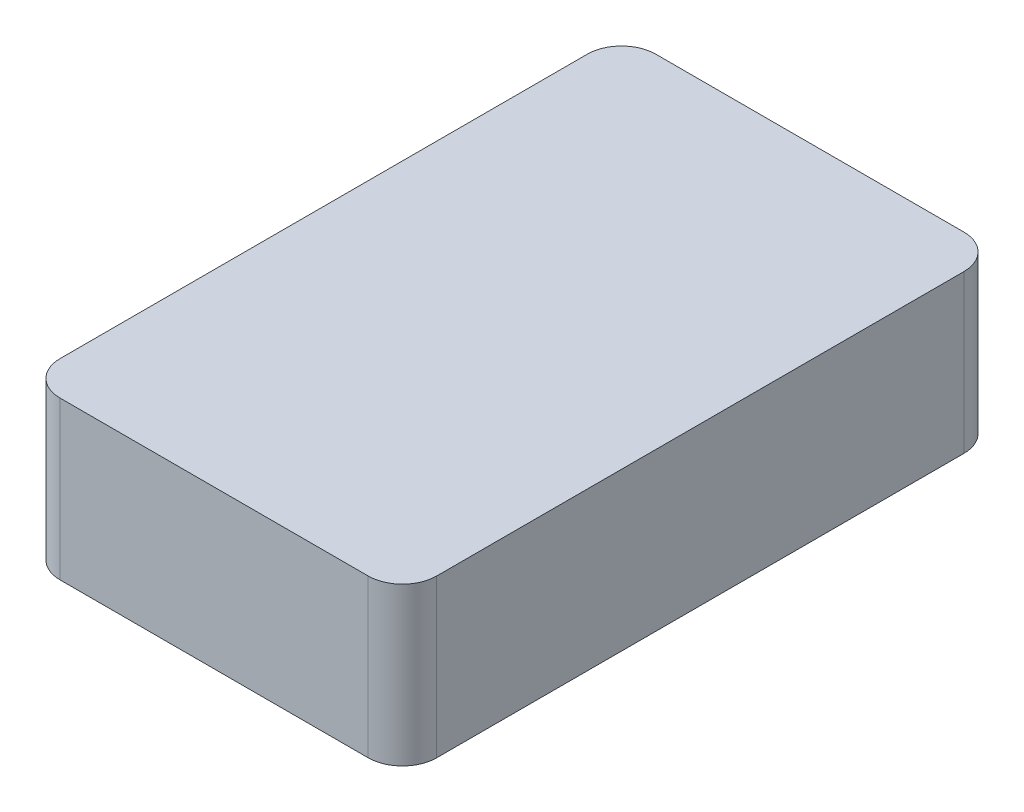
ISO-10303-21;
HEADER;
FILE_DESCRIPTION(('STEP AP214'),'2;1');
FILE_NAME('part.step','',(''),(''),'','','');
FILE_SCHEMA(('AUTOMOTIVE_DESIGN { 1 0 10303 214 1 1 1 1 }'));
ENDSEC;
DATA;
#1=APPLICATION_CONTEXT('core data for automotive mechanical design processes');
#2=APPLICATION_PROTOCOL_DEFINITION('international standard','automotive_design',2000,#1);
#3=PRODUCT_CONTEXT('',#1,'mechanical');
#4=PRODUCT('Part','Part','',(#3));
#5=PRODUCT_RELATED_PRODUCT_CATEGORY('part','',(#4));
#6=PRODUCT_DEFINITION_FORMATION('','',#4);
#7=PRODUCT_DEFINITION_CONTEXT('part definition',#1,'design');
#8=PRODUCT_DEFINITION('design','',#6,#7);
#9=PRODUCT_DEFINITION_SHAPE('','',#8);
#10=(LENGTH_UNIT() NAMED_UNIT(*) SI_UNIT(.MILLI.,.METRE.));
#11=(NAMED_UNIT(*) PLANE_ANGLE_UNIT() SI_UNIT($,.RADIAN.));
#12=(NAMED_UNIT(*) SI_UNIT($,.STERADIAN.) SOLID_ANGLE_UNIT());
#13=UNCERTAINTY_MEASURE_WITH_UNIT(LENGTH_MEASURE(1.E-05),#10,'distance_accuracy_value','');
#14=(GEOMETRIC_REPRESENTATION_CONTEXT(3) GLOBAL_UNCERTAINTY_ASSIGNED_CONTEXT((#13)) GLOBAL_UNIT_ASSIGNED_CONTEXT((#10,
#11,#12)) REPRESENTATION_CONTEXT('',''));
#15=CARTESIAN_POINT('',(0.,0.,0.));
#16=DIRECTION('',(0.,0.,1.));
#17=DIRECTION('',(1.,0.,0.));
#18=AXIS2_PLACEMENT_3D('',#15,#16,#17);
#19=CARTESIAN_POINT('',(-34.9399313153594,23.,20.7841209187291));
#20=DIRECTION('',(0.,-1.,0.));
#21=DIRECTION('',(0.,0.,-1.));
#22=AXIS2_PLACEMENT_3D('',#19,#20,#21);
#23=CYLINDRICAL_SURFACE('',#22,5.);
#24=CARTESIAN_POINT('',(-34.9399313153594,0.,20.7841209187291));
#25=DIRECTION('',(0.,1.,0.));
#26=DIRECTION('',(0.,0.,1.));
#27=AXIS2_PLACEMENT_3D('',#24,#25,#26);
#28=CIRCLE('',#27,5.);
#29=CARTESIAN_POINT('',(-39.9399313153594,0.,20.784120918729));
#30=VERTEX_POINT('',#29);
#31=CARTESIAN_POINT('',(-34.9399313153594,0.,25.7841209187291));
#32=VERTEX_POINT('',#31);
#33=EDGE_CURVE('E133',#30,#32,#28,.T.);
#34=ORIENTED_EDGE('',*,*,#33,.T.);
#35=DIRECTION('',(0.,-1.,0.));
#36=VECTOR('',#35,1.);
#37=CARTESIAN_POINT('',(-34.9399313153594,23.,25.7841209187291));
#38=LINE('',#37,#36);
#39=CARTESIAN_POINT('',(-34.9399313153594,23.,25.7841209187291));
#40=VERTEX_POINT('',#39);
#41=EDGE_CURVE('E11',#40,#32,#38,.T.);
#42=ORIENTED_EDGE('',*,*,#41,.F.);
#43=CARTESIAN_POINT('',(-34.9399313153594,23.,20.7841209187291));
#44=DIRECTION('',(0.,1.,0.));
#45=DIRECTION('',(0.,0.,1.));
#46=AXIS2_PLACEMENT_3D('',#43,#44,#45);
#47=CIRCLE('',#46,5.);
#48=CARTESIAN_POINT('',(-39.9399313153594,23.,20.784120918729));
#49=VERTEX_POINT('',#48);
#50=EDGE_CURVE('E147',#49,#40,#47,.T.);
#51=ORIENTED_EDGE('',*,*,#50,.F.);
#52=DIRECTION('',(0.,-1.,0.));
#53=VECTOR('',#52,1.);
#54=CARTESIAN_POINT('',(-39.9399313153594,23.,20.784120918729));
#55=LINE('',#54,#53);
#56=EDGE_CURVE('E129',#49,#30,#55,.T.);
#57=ORIENTED_EDGE('',*,*,#56,.T.);
#58=EDGE_LOOP('',(#34,#42,#51,#57));
#59=FACE_BOUND('',#58,.T.);
#60=ADVANCED_FACE('F37',(#59),#23,.T.);
#61=CARTESIAN_POINT('',(-34.9399313153594,23.,25.7841209187291));
#62=DIRECTION('',(0.,0.,-1.));
#63=DIRECTION('',(-1.,0.,0.));
#64=AXIS2_PLACEMENT_3D('',#61,#62,#63);
#65=PLANE('',#64);
#66=DIRECTION('',(1.,0.,0.));
#67=VECTOR('',#66,1.);
#68=CARTESIAN_POINT('',(-34.9399313153594,0.,25.7841209187291));
#69=LINE('',#68,#67);
#70=CARTESIAN_POINT('',(10.0600686846405,0.,25.7841209187291));
#71=VERTEX_POINT('',#70);
#72=EDGE_CURVE('E136',#32,#71,#69,.T.);
#73=ORIENTED_EDGE('',*,*,#72,.T.);
#74=DIRECTION('',(0.,-1.,0.));
#75=VECTOR('',#74,1.);
#76=CARTESIAN_POINT('',(10.0600686846405,23.,25.7841209187291));
#77=LINE('',#76,#75);
#78=CARTESIAN_POINT('',(10.0600686846405,23.,25.7841209187291));
#79=VERTEX_POINT('',#78);
#80=EDGE_CURVE('E45',#79,#71,#77,.T.);
#81=ORIENTED_EDGE('',*,*,#80,.F.);
#82=DIRECTION('',(1.,0.,0.));
#83=VECTOR('',#82,1.);
#84=CARTESIAN_POINT('',(-34.9399313153594,23.,25.7841209187291));
#85=LINE('',#84,#83);
#86=EDGE_CURVE('E96',#40,#79,#85,.T.);
#87=ORIENTED_EDGE('',*,*,#86,.F.);
#88=ORIENTED_EDGE('',*,*,#41,.T.);
#89=EDGE_LOOP('',(#73,#81,#87,#88));
#90=FACE_BOUND('',#89,.T.);
#91=ADVANCED_FACE('F182',(#90),#65,.F.);
#92=CARTESIAN_POINT('',(10.0600686846406,23.,20.7841209187291));
#93=DIRECTION('',(0.,-1.,0.));
#94=DIRECTION('',(0.,0.,-1.));
#95=AXIS2_PLACEMENT_3D('',#92,#93,#94);
#96=CYLINDRICAL_SURFACE('',#95,5.);
#97=CARTESIAN_POINT('',(10.0600686846406,0.,20.7841209187291));
#98=DIRECTION('',(0.,1.,0.));
#99=DIRECTION('',(0.,0.,1.));
#100=AXIS2_PLACEMENT_3D('',#97,#98,#99);
#101=CIRCLE('',#100,5.);
#102=CARTESIAN_POINT('',(15.0600686846406,0.,20.784120918729));
#103=VERTEX_POINT('',#102);
#104=EDGE_CURVE('E138',#71,#103,#101,.T.);
#105=ORIENTED_EDGE('',*,*,#104,.T.);
#106=DIRECTION('',(0.,-1.,0.));
#107=VECTOR('',#106,1.);
#108=CARTESIAN_POINT('',(15.0600686846406,23.,20.784120918729));
#109=LINE('',#108,#107);
#110=CARTESIAN_POINT('',(15.0600686846406,23.,20.784120918729));
#111=VERTEX_POINT('',#110);
#112=EDGE_CURVE('E154',#111,#103,#109,.T.);
#113=ORIENTED_EDGE('',*,*,#112,.F.);
#114=CARTESIAN_POINT('',(10.0600686846406,23.,20.7841209187291));
#115=DIRECTION('',(0.,1.,0.));
#116=DIRECTION('',(0.,0.,1.));
#117=AXIS2_PLACEMENT_3D('',#114,#115,#116);
#118=CIRCLE('',#117,5.);
#119=EDGE_CURVE('E162',#79,#111,#118,.T.);
#120=ORIENTED_EDGE('',*,*,#119,.F.);
#121=ORIENTED_EDGE('',*,*,#80,.T.);
#122=EDGE_LOOP('',(#105,#113,#120,#121));
#123=FACE_BOUND('',#122,.T.);
#124=ADVANCED_FACE('F160',(#123),#96,.T.);
#125=CARTESIAN_POINT('',(15.0600686846406,23.,20.784120918729));
#126=DIRECTION('',(-1.,0.,0.));
#127=DIRECTION('',(0.,0.,1.));
#128=AXIS2_PLACEMENT_3D('',#125,#126,#127);
#129=PLANE('',#128);
#130=DIRECTION('',(0.,0.,-1.));
#131=VECTOR('',#130,1.);
#132=CARTESIAN_POINT('',(15.0600686846406,0.,20.784120918729));
#133=LINE('',#132,#131);
#134=CARTESIAN_POINT('',(15.0600686846406,0.,-56.2158790812709));
#135=VERTEX_POINT('',#134);
#136=EDGE_CURVE('E140',#103,#135,#133,.T.);
#137=ORIENTED_EDGE('',*,*,#136,.T.);
#138=DIRECTION('',(0.,-1.,0.));
#139=VECTOR('',#138,1.);
#140=CARTESIAN_POINT('',(15.0600686846406,23.,-56.2158790812709));
#141=LINE('',#140,#139);
#142=CARTESIAN_POINT('',(15.0600686846406,23.,-56.2158790812709));
#143=VERTEX_POINT('',#142);
#144=EDGE_CURVE('E151',#143,#135,#141,.T.);
#145=ORIENTED_EDGE('',*,*,#144,.F.);
#146=DIRECTION('',(0.,0.,-1.));
#147=VECTOR('',#146,1.);
#148=CARTESIAN_POINT('',(15.0600686846406,23.,20.784120918729));
#149=LINE('',#148,#147);
#150=EDGE_CURVE('E174',#111,#143,#149,.T.);
#151=ORIENTED_EDGE('',*,*,#150,.F.);
#152=ORIENTED_EDGE('',*,*,#112,.T.);
#153=EDGE_LOOP('',(#137,#145,#151,#152));
#154=FACE_BOUND('',#153,.T.);
#155=ADVANCED_FACE('F170',(#154),#129,.F.);
#156=CARTESIAN_POINT('',(10.0600686846406,23.,-56.2158790812709));
#157=DIRECTION('',(0.,-1.,0.));
#158=DIRECTION('',(0.,0.,-1.));
#159=AXIS2_PLACEMENT_3D('',#156,#157,#158);
#160=CYLINDRICAL_SURFACE('',#159,5.);
#161=CARTESIAN_POINT('',(10.0600686846406,0.,-56.2158790812709));
#162=DIRECTION('',(0.,1.,0.));
#163=DIRECTION('',(0.,0.,-1.));
#164=AXIS2_PLACEMENT_3D('',#161,#162,#163);
#165=CIRCLE('',#164,5.);
#166=CARTESIAN_POINT('',(10.0600686846405,0.,-61.2158790812709));
#167=VERTEX_POINT('',#166);
#168=EDGE_CURVE('E142',#135,#167,#165,.T.);
#169=ORIENTED_EDGE('',*,*,#168,.T.);
#170=DIRECTION('',(0.,-1.,0.));
#171=VECTOR('',#170,1.);
#172=CARTESIAN_POINT('',(10.0600686846405,23.,-61.2158790812709));
#173=LINE('',#172,#171);
#174=CARTESIAN_POINT('',(10.0600686846405,23.,-61.2158790812709));
#175=VERTEX_POINT('',#174);
#176=EDGE_CURVE('E124',#175,#167,#173,.T.);
#177=ORIENTED_EDGE('',*,*,#176,.F.);
#178=CARTESIAN_POINT('',(10.0600686846406,23.,-56.2158790812709));
#179=DIRECTION('',(0.,1.,0.));
#180=DIRECTION('',(0.,0.,-1.));
#181=AXIS2_PLACEMENT_3D('',#178,#179,#180);
#182=CIRCLE('',#181,5.);
#183=EDGE_CURVE('E115',#143,#175,#182,.T.);
#184=ORIENTED_EDGE('',*,*,#183,.F.);
#185=ORIENTED_EDGE('',*,*,#144,.T.);
#186=EDGE_LOOP('',(#169,#177,#184,#185));
#187=FACE_BOUND('',#186,.T.);
#188=ADVANCED_FACE('F173',(#187),#160,.T.);
#189=CARTESIAN_POINT('',(-34.9399313153594,23.,-61.2158790812709));
#190=DIRECTION('',(0.,0.,1.));
#191=DIRECTION('',(1.,0.,0.));
#192=AXIS2_PLACEMENT_3D('',#189,#190,#191);
#193=PLANE('',#192);
#194=DIRECTION('',(-1.,0.,0.));
#195=VECTOR('',#194,1.);
#196=CARTESIAN_POINT('',(-34.9399313153594,0.,-61.2158790812709));
#197=LINE('',#196,#195);
#198=CARTESIAN_POINT('',(-34.9399313153594,0.,-61.2158790812709));
#199=VERTEX_POINT('',#198);
#200=EDGE_CURVE('E123',#167,#199,#197,.T.);
#201=ORIENTED_EDGE('',*,*,#200,.T.);
#202=DIRECTION('',(0.,-1.,0.));
#203=VECTOR('',#202,1.);
#204=CARTESIAN_POINT('',(-34.9399313153594,23.,-61.2158790812709));
#205=LINE('',#204,#203);
#206=CARTESIAN_POINT('',(-34.9399313153594,23.,-61.2158790812709));
#207=VERTEX_POINT('',#206);
#208=EDGE_CURVE('E120',#207,#199,#205,.T.);
#209=ORIENTED_EDGE('',*,*,#208,.F.);
#210=DIRECTION('',(-1.,0.,0.));
#211=VECTOR('',#210,1.);
#212=CARTESIAN_POINT('',(-34.9399313153594,23.,-61.2158790812709));
#213=LINE('',#212,#211);
#214=EDGE_CURVE('E109',#175,#207,#213,.T.);
#215=ORIENTED_EDGE('',*,*,#214,.F.);
#216=ORIENTED_EDGE('',*,*,#176,.T.);
#217=EDGE_LOOP('',(#201,#209,#215,#216));
#218=FACE_BOUND('',#217,.T.);
#219=ADVANCED_FACE('F121',(#218),#193,.F.);
#220=CARTESIAN_POINT('',(-34.9399313153594,23.,-56.2158790812709));
#221=DIRECTION('',(0.,-1.,0.));
#222=DIRECTION('',(0.,0.,-1.));
#223=AXIS2_PLACEMENT_3D('',#220,#221,#222);
#224=CYLINDRICAL_SURFACE('',#223,5.);
#225=CARTESIAN_POINT('',(-34.9399313153594,0.,-56.2158790812709));
#226=DIRECTION('',(0.,1.,0.));
#227=DIRECTION('',(0.,0.,-1.));
#228=AXIS2_PLACEMENT_3D('',#225,#226,#227);
#229=CIRCLE('',#228,5.);
#230=CARTESIAN_POINT('',(-39.9399313153594,0.,-56.2158790812709));
#231=VERTEX_POINT('',#230);
#232=EDGE_CURVE('E82',#199,#231,#229,.T.);
#233=ORIENTED_EDGE('',*,*,#232,.T.);
#234=DIRECTION('',(0.,-1.,0.));
#235=VECTOR('',#234,1.);
#236=CARTESIAN_POINT('',(-39.9399313153594,23.,-56.2158790812709));
#237=LINE('',#236,#235);
#238=CARTESIAN_POINT('',(-39.9399313153594,23.,-56.2158790812709));
#239=VERTEX_POINT('',#238);
#240=EDGE_CURVE('E125',#239,#231,#237,.T.);
#241=ORIENTED_EDGE('',*,*,#240,.F.);
#242=CARTESIAN_POINT('',(-34.9399313153594,23.,-56.2158790812709));
#243=DIRECTION('',(0.,1.,0.));
#244=DIRECTION('',(0.,0.,-1.));
#245=AXIS2_PLACEMENT_3D('',#242,#243,#244);
#246=CIRCLE('',#245,5.);
#247=EDGE_CURVE('E113',#207,#239,#246,.T.);
#248=ORIENTED_EDGE('',*,*,#247,.F.);
#249=ORIENTED_EDGE('',*,*,#208,.T.);
#250=EDGE_LOOP('',(#233,#241,#248,#249));
#251=FACE_BOUND('',#250,.T.);
#252=ADVANCED_FACE('F127',(#251),#224,.T.);
#253=CARTESIAN_POINT('',(-39.9399313153594,23.,20.784120918729));
#254=DIRECTION('',(1.,0.,0.));
#255=DIRECTION('',(0.,0.,-1.));
#256=AXIS2_PLACEMENT_3D('',#253,#254,#255);
#257=PLANE('',#256);
#258=DIRECTION('',(0.,0.,1.));
#259=VECTOR('',#258,1.);
#260=CARTESIAN_POINT('',(-39.9399313153594,0.,20.784120918729));
#261=LINE('',#260,#259);
#262=EDGE_CURVE('E88',#231,#30,#261,.T.);
#263=ORIENTED_EDGE('',*,*,#262,.T.);
#264=ORIENTED_EDGE('',*,*,#56,.F.);
#265=DIRECTION('',(0.,0.,1.));
#266=VECTOR('',#265,1.);
#267=CARTESIAN_POINT('',(-39.9399313153594,23.,20.784120918729));
#268=LINE('',#267,#266);
#269=EDGE_CURVE('E53',#239,#49,#268,.T.);
#270=ORIENTED_EDGE('',*,*,#269,.F.);
#271=ORIENTED_EDGE('',*,*,#240,.T.);
#272=EDGE_LOOP('',(#263,#264,#270,#271));
#273=FACE_BOUND('',#272,.T.);
#274=ADVANCED_FACE('F198',(#273),#257,.F.);
#275=CARTESIAN_POINT('',(-34.9399313153594,23.,20.7841209187291));
#276=DIRECTION('',(0.,1.,0.));
#277=DIRECTION('',(0.,0.,1.));
#278=AXIS2_PLACEMENT_3D('',#275,#276,#277);
#279=PLANE('',#278);
#280=ORIENTED_EDGE('',*,*,#50,.T.);
#281=ORIENTED_EDGE('',*,*,#86,.T.);
#282=ORIENTED_EDGE('',*,*,#119,.T.);
#283=ORIENTED_EDGE('',*,*,#150,.T.);
#284=ORIENTED_EDGE('',*,*,#183,.T.);
#285=ORIENTED_EDGE('',*,*,#214,.T.);
#286=ORIENTED_EDGE('',*,*,#247,.T.);
#287=ORIENTED_EDGE('',*,*,#269,.T.);
#288=EDGE_LOOP('',(#280,#281,#282,#283,#284,#285,#286,#287));
#289=FACE_BOUND('',#288,.T.);
#290=ADVANCED_FACE('F111',(#289),#279,.T.);
#291=CARTESIAN_POINT('',(-34.9399313153594,0.,20.7841209187291));
#292=DIRECTION('',(0.,1.,0.));
#293=DIRECTION('',(0.,0.,1.));
#294=AXIS2_PLACEMENT_3D('',#291,#292,#293);
#295=PLANE('',#294);
#296=ORIENTED_EDGE('',*,*,#33,.F.);
#297=ORIENTED_EDGE('',*,*,#262,.F.);
#298=ORIENTED_EDGE('',*,*,#232,.F.);
#299=ORIENTED_EDGE('',*,*,#200,.F.);
#300=ORIENTED_EDGE('',*,*,#168,.F.);
#301=ORIENTED_EDGE('',*,*,#136,.F.);
#302=ORIENTED_EDGE('',*,*,#104,.F.);
#303=ORIENTED_EDGE('',*,*,#72,.F.);
#304=EDGE_LOOP('',(#296,#297,#298,#299,#300,#301,#302,#303));
#305=FACE_BOUND('',#304,.T.);
#306=ADVANCED_FACE('F166',(#305),#295,.F.);
#307=CLOSED_SHELL('',(#60,#91,#124,#155,#188,#219,#252,#274,#290,#306));
#308=MANIFOLD_SOLID_BREP('B2',#307);
#309=ADVANCED_BREP_SHAPE_REPRESENTATION('',(#18,#308),#14);
#310=SHAPE_DEFINITION_REPRESENTATION(#9,#309);
ENDSEC;
END-ISO-10303-21;
